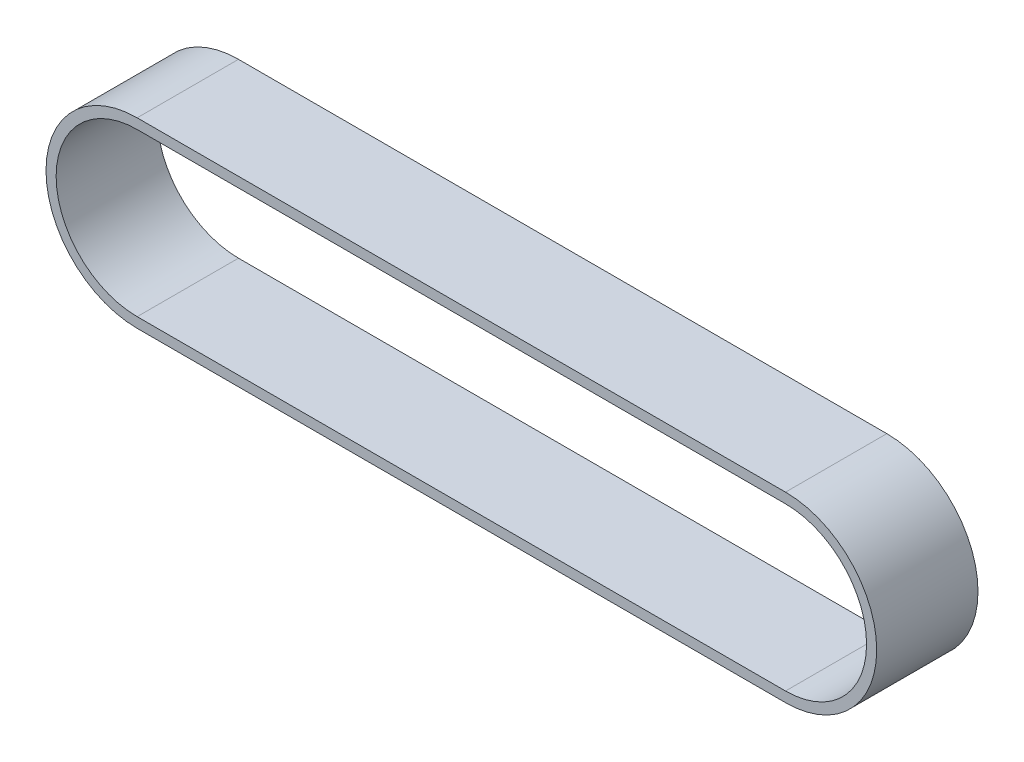
ISO-10303-21;
HEADER;
FILE_DESCRIPTION(('STEP AP214'),'2;1');
FILE_NAME('part.step','',(''),(''),'','','');
FILE_SCHEMA(('AUTOMOTIVE_DESIGN { 1 0 10303 214 1 1 1 1 }'));
ENDSEC;
DATA;
#1=APPLICATION_CONTEXT('core data for automotive mechanical design processes');
#2=APPLICATION_PROTOCOL_DEFINITION('international standard','automotive_design',2000,#1);
#3=PRODUCT_CONTEXT('',#1,'mechanical');
#4=PRODUCT('Part','Part','',(#3));
#5=PRODUCT_RELATED_PRODUCT_CATEGORY('part','',(#4));
#6=PRODUCT_DEFINITION_FORMATION('','',#4);
#7=PRODUCT_DEFINITION_CONTEXT('part definition',#1,'design');
#8=PRODUCT_DEFINITION('design','',#6,#7);
#9=PRODUCT_DEFINITION_SHAPE('','',#8);
#10=(LENGTH_UNIT() NAMED_UNIT(*) SI_UNIT(.MILLI.,.METRE.));
#11=(NAMED_UNIT(*) PLANE_ANGLE_UNIT() SI_UNIT($,.RADIAN.));
#12=(NAMED_UNIT(*) SI_UNIT($,.STERADIAN.) SOLID_ANGLE_UNIT());
#13=UNCERTAINTY_MEASURE_WITH_UNIT(LENGTH_MEASURE(1.E-05),#10,'distance_accuracy_value','');
#14=(GEOMETRIC_REPRESENTATION_CONTEXT(3) GLOBAL_UNCERTAINTY_ASSIGNED_CONTEXT((#13)) GLOBAL_UNIT_ASSIGNED_CONTEXT((#10,
#11,#12)) REPRESENTATION_CONTEXT('',''));
#15=CARTESIAN_POINT('',(0.,0.,0.));
#16=DIRECTION('',(0.,0.,1.));
#17=DIRECTION('',(1.,0.,0.));
#18=AXIS2_PLACEMENT_3D('',#15,#16,#17);
#19=CARTESIAN_POINT('',(0.,0.,50.));
#20=DIRECTION('',(0.,0.,1.));
#21=DIRECTION('',(1.,0.,0.));
#22=AXIS2_PLACEMENT_3D('',#19,#20,#21);
#23=PLANE('',#22);
#24=CARTESIAN_POINT('',(0.,0.,50.));
#25=DIRECTION('',(0.,0.,1.));
#26=DIRECTION('',(1.,0.,0.));
#27=AXIS2_PLACEMENT_3D('',#24,#25,#26);
#28=CIRCLE('',#27,45.);
#29=CARTESIAN_POINT('',(0.,45.,50.));
#30=VERTEX_POINT('',#29);
#31=CARTESIAN_POINT('',(0.,-45.,50.));
#32=VERTEX_POINT('',#31);
#33=EDGE_CURVE('E157',#30,#32,#28,.T.);
#34=ORIENTED_EDGE('',*,*,#33,.T.);
#35=DIRECTION('',(1.,0.,0.));
#36=VECTOR('',#35,1.);
#37=CARTESIAN_POINT('',(0.,-45.,50.));
#38=LINE('',#37,#36);
#39=CARTESIAN_POINT('',(320.,-45.,50.));
#40=VERTEX_POINT('',#39);
#41=EDGE_CURVE('E161',#32,#40,#38,.T.);
#42=ORIENTED_EDGE('',*,*,#41,.T.);
#43=CARTESIAN_POINT('',(320.,0.,50.));
#44=DIRECTION('',(0.,0.,1.));
#45=DIRECTION('',(1.,0.,0.));
#46=AXIS2_PLACEMENT_3D('',#43,#44,#45);
#47=CIRCLE('',#46,45.);
#48=CARTESIAN_POINT('',(320.,45.,50.));
#49=VERTEX_POINT('',#48);
#50=EDGE_CURVE('E165',#40,#49,#47,.T.);
#51=ORIENTED_EDGE('',*,*,#50,.T.);
#52=DIRECTION('',(-1.,0.,0.));
#53=VECTOR('',#52,1.);
#54=CARTESIAN_POINT('',(0.,45.,50.));
#55=LINE('',#54,#53);
#56=EDGE_CURVE('E168',#49,#30,#55,.T.);
#57=ORIENTED_EDGE('',*,*,#56,.T.);
#58=EDGE_LOOP('',(#34,#42,#51,#57));
#59=FACE_BOUND('',#58,.T.);
#60=DIRECTION('',(1.,0.,0.));
#61=VECTOR('',#60,1.);
#62=CARTESIAN_POINT('',(0.,-40.,50.));
#63=LINE('',#62,#61);
#64=CARTESIAN_POINT('',(0.,-40.,50.));
#65=VERTEX_POINT('',#64);
#66=CARTESIAN_POINT('',(320.,-40.,50.));
#67=VERTEX_POINT('',#66);
#68=EDGE_CURVE('E118',#65,#67,#63,.T.);
#69=ORIENTED_EDGE('',*,*,#68,.F.);
#70=CARTESIAN_POINT('',(0.,0.,50.));
#71=DIRECTION('',(0.,0.,1.));
#72=DIRECTION('',(1.,0.,0.));
#73=AXIS2_PLACEMENT_3D('',#70,#71,#72);
#74=CIRCLE('',#73,40.);
#75=CARTESIAN_POINT('',(0.,40.,50.));
#76=VERTEX_POINT('',#75);
#77=EDGE_CURVE('E109',#76,#65,#74,.T.);
#78=ORIENTED_EDGE('',*,*,#77,.F.);
#79=DIRECTION('',(-1.,0.,0.));
#80=VECTOR('',#79,1.);
#81=CARTESIAN_POINT('',(0.,40.,50.));
#82=LINE('',#81,#80);
#83=CARTESIAN_POINT('',(320.,40.,50.));
#84=VERTEX_POINT('',#83);
#85=EDGE_CURVE('E135',#84,#76,#82,.T.);
#86=ORIENTED_EDGE('',*,*,#85,.F.);
#87=CARTESIAN_POINT('',(320.,0.,50.));
#88=DIRECTION('',(0.,0.,1.));
#89=DIRECTION('',(1.,0.,0.));
#90=AXIS2_PLACEMENT_3D('',#87,#88,#89);
#91=CIRCLE('',#90,40.);
#92=EDGE_CURVE('E131',#67,#84,#91,.T.);
#93=ORIENTED_EDGE('',*,*,#92,.F.);
#94=EDGE_LOOP('',(#69,#78,#86,#93));
#95=FACE_BOUND('',#94,.T.);
#96=ADVANCED_FACE('F43',(#59,#95),#23,.T.);
#97=CARTESIAN_POINT('',(0.,0.,0.));
#98=DIRECTION('',(0.,0.,1.));
#99=DIRECTION('',(1.,0.,0.));
#100=AXIS2_PLACEMENT_3D('',#97,#98,#99);
#101=PLANE('',#100);
#102=CARTESIAN_POINT('',(0.,0.,0.));
#103=DIRECTION('',(0.,0.,1.));
#104=DIRECTION('',(1.,0.,0.));
#105=AXIS2_PLACEMENT_3D('',#102,#103,#104);
#106=CIRCLE('',#105,45.);
#107=CARTESIAN_POINT('',(0.,45.,0.));
#108=VERTEX_POINT('',#107);
#109=CARTESIAN_POINT('',(0.,-45.,0.));
#110=VERTEX_POINT('',#109);
#111=EDGE_CURVE('E127',#108,#110,#106,.T.);
#112=ORIENTED_EDGE('',*,*,#111,.F.);
#113=DIRECTION('',(-1.,0.,0.));
#114=VECTOR('',#113,1.);
#115=CARTESIAN_POINT('',(0.,45.,0.));
#116=LINE('',#115,#114);
#117=CARTESIAN_POINT('',(320.,45.,0.));
#118=VERTEX_POINT('',#117);
#119=EDGE_CURVE('E162',#118,#108,#116,.T.);
#120=ORIENTED_EDGE('',*,*,#119,.F.);
#121=CARTESIAN_POINT('',(320.,0.,0.));
#122=DIRECTION('',(0.,0.,1.));
#123=DIRECTION('',(1.,0.,0.));
#124=AXIS2_PLACEMENT_3D('',#121,#122,#123);
#125=CIRCLE('',#124,45.);
#126=CARTESIAN_POINT('',(320.,-45.,0.));
#127=VERTEX_POINT('',#126);
#128=EDGE_CURVE('E178',#127,#118,#125,.T.);
#129=ORIENTED_EDGE('',*,*,#128,.F.);
#130=DIRECTION('',(1.,0.,0.));
#131=VECTOR('',#130,1.);
#132=CARTESIAN_POINT('',(0.,-45.,0.));
#133=LINE('',#132,#131);
#134=EDGE_CURVE('E175',#110,#127,#133,.T.);
#135=ORIENTED_EDGE('',*,*,#134,.F.);
#136=EDGE_LOOP('',(#112,#120,#129,#135));
#137=FACE_BOUND('',#136,.T.);
#138=CARTESIAN_POINT('',(0.,0.,0.));
#139=DIRECTION('',(0.,0.,1.));
#140=DIRECTION('',(1.,0.,0.));
#141=AXIS2_PLACEMENT_3D('',#138,#139,#140);
#142=CIRCLE('',#141,40.);
#143=CARTESIAN_POINT('',(0.,40.,0.));
#144=VERTEX_POINT('',#143);
#145=CARTESIAN_POINT('',(0.,-40.,0.));
#146=VERTEX_POINT('',#145);
#147=EDGE_CURVE('E67',#144,#146,#142,.T.);
#148=ORIENTED_EDGE('',*,*,#147,.T.);
#149=DIRECTION('',(1.,0.,0.));
#150=VECTOR('',#149,1.);
#151=CARTESIAN_POINT('',(0.,-40.,0.));
#152=LINE('',#151,#150);
#153=CARTESIAN_POINT('',(320.,-40.,0.));
#154=VERTEX_POINT('',#153);
#155=EDGE_CURVE('E125',#146,#154,#152,.T.);
#156=ORIENTED_EDGE('',*,*,#155,.T.);
#157=CARTESIAN_POINT('',(320.,0.,0.));
#158=DIRECTION('',(0.,0.,1.));
#159=DIRECTION('',(1.,0.,0.));
#160=AXIS2_PLACEMENT_3D('',#157,#158,#159);
#161=CIRCLE('',#160,40.);
#162=CARTESIAN_POINT('',(320.,40.,0.));
#163=VERTEX_POINT('',#162);
#164=EDGE_CURVE('E144',#154,#163,#161,.T.);
#165=ORIENTED_EDGE('',*,*,#164,.T.);
#166=DIRECTION('',(-1.,0.,0.));
#167=VECTOR('',#166,1.);
#168=CARTESIAN_POINT('',(0.,40.,0.));
#169=LINE('',#168,#167);
#170=EDGE_CURVE('E119',#163,#144,#169,.T.);
#171=ORIENTED_EDGE('',*,*,#170,.T.);
#172=EDGE_LOOP('',(#148,#156,#165,#171));
#173=FACE_BOUND('',#172,.T.);
#174=ADVANCED_FACE('F201',(#137,#173),#101,.F.);
#175=CARTESIAN_POINT('',(0.,0.,50.));
#176=DIRECTION('',(0.,0.,-1.));
#177=DIRECTION('',(-1.,0.,0.));
#178=AXIS2_PLACEMENT_3D('',#175,#176,#177);
#179=CYLINDRICAL_SURFACE('',#178,45.);
#180=ORIENTED_EDGE('',*,*,#111,.T.);
#181=DIRECTION('',(0.,0.,-1.));
#182=VECTOR('',#181,1.);
#183=CARTESIAN_POINT('',(0.,-45.,50.));
#184=LINE('',#183,#182);
#185=EDGE_CURVE('E11',#32,#110,#184,.T.);
#186=ORIENTED_EDGE('',*,*,#185,.F.);
#187=ORIENTED_EDGE('',*,*,#33,.F.);
#188=DIRECTION('',(0.,0.,-1.));
#189=VECTOR('',#188,1.);
#190=CARTESIAN_POINT('',(0.,45.,50.));
#191=LINE('',#190,#189);
#192=EDGE_CURVE('E171',#30,#108,#191,.T.);
#193=ORIENTED_EDGE('',*,*,#192,.T.);
#194=EDGE_LOOP('',(#180,#186,#187,#193));
#195=FACE_BOUND('',#194,.T.);
#196=ADVANCED_FACE('F45',(#195),#179,.T.);
#197=CARTESIAN_POINT('',(0.,-45.,50.));
#198=DIRECTION('',(0.,1.,0.));
#199=DIRECTION('',(0.,0.,1.));
#200=AXIS2_PLACEMENT_3D('',#197,#198,#199);
#201=PLANE('',#200);
#202=ORIENTED_EDGE('',*,*,#134,.T.);
#203=DIRECTION('',(0.,0.,-1.));
#204=VECTOR('',#203,1.);
#205=CARTESIAN_POINT('',(320.,-45.,50.));
#206=LINE('',#205,#204);
#207=EDGE_CURVE('E52',#40,#127,#206,.T.);
#208=ORIENTED_EDGE('',*,*,#207,.F.);
#209=ORIENTED_EDGE('',*,*,#41,.F.);
#210=ORIENTED_EDGE('',*,*,#185,.T.);
#211=EDGE_LOOP('',(#202,#208,#209,#210));
#212=FACE_BOUND('',#211,.T.);
#213=ADVANCED_FACE('F211',(#212),#201,.F.);
#214=CARTESIAN_POINT('',(320.,0.,50.));
#215=DIRECTION('',(0.,0.,-1.));
#216=DIRECTION('',(-1.,0.,0.));
#217=AXIS2_PLACEMENT_3D('',#214,#215,#216);
#218=CYLINDRICAL_SURFACE('',#217,45.);
#219=ORIENTED_EDGE('',*,*,#128,.T.);
#220=DIRECTION('',(0.,0.,-1.));
#221=VECTOR('',#220,1.);
#222=CARTESIAN_POINT('',(320.,45.,50.));
#223=LINE('',#222,#221);
#224=EDGE_CURVE('E186',#49,#118,#223,.T.);
#225=ORIENTED_EDGE('',*,*,#224,.F.);
#226=ORIENTED_EDGE('',*,*,#50,.F.);
#227=ORIENTED_EDGE('',*,*,#207,.T.);
#228=EDGE_LOOP('',(#219,#225,#226,#227));
#229=FACE_BOUND('',#228,.T.);
#230=ADVANCED_FACE('F195',(#229),#218,.T.);
#231=CARTESIAN_POINT('',(0.,45.,50.));
#232=DIRECTION('',(0.,-1.,0.));
#233=DIRECTION('',(0.,0.,-1.));
#234=AXIS2_PLACEMENT_3D('',#231,#232,#233);
#235=PLANE('',#234);
#236=ORIENTED_EDGE('',*,*,#119,.T.);
#237=ORIENTED_EDGE('',*,*,#192,.F.);
#238=ORIENTED_EDGE('',*,*,#56,.F.);
#239=ORIENTED_EDGE('',*,*,#224,.T.);
#240=EDGE_LOOP('',(#236,#237,#238,#239));
#241=FACE_BOUND('',#240,.T.);
#242=ADVANCED_FACE('F205',(#241),#235,.F.);
#243=CARTESIAN_POINT('',(0.,0.,50.));
#244=DIRECTION('',(0.,0.,-1.));
#245=DIRECTION('',(-1.,0.,0.));
#246=AXIS2_PLACEMENT_3D('',#243,#244,#245);
#247=CYLINDRICAL_SURFACE('',#246,40.);
#248=ORIENTED_EDGE('',*,*,#147,.F.);
#249=DIRECTION('',(0.,0.,-1.));
#250=VECTOR('',#249,1.);
#251=CARTESIAN_POINT('',(0.,40.,50.));
#252=LINE('',#251,#250);
#253=EDGE_CURVE('E113',#76,#144,#252,.T.);
#254=ORIENTED_EDGE('',*,*,#253,.F.);
#255=ORIENTED_EDGE('',*,*,#77,.T.);
#256=DIRECTION('',(0.,0.,-1.));
#257=VECTOR('',#256,1.);
#258=CARTESIAN_POINT('',(0.,-40.,50.));
#259=LINE('',#258,#257);
#260=EDGE_CURVE('E112',#65,#146,#259,.T.);
#261=ORIENTED_EDGE('',*,*,#260,.T.);
#262=EDGE_LOOP('',(#248,#254,#255,#261));
#263=FACE_BOUND('',#262,.T.);
#264=ADVANCED_FACE('F111',(#263),#247,.F.);
#265=CARTESIAN_POINT('',(0.,-40.,50.));
#266=DIRECTION('',(0.,1.,0.));
#267=DIRECTION('',(0.,0.,1.));
#268=AXIS2_PLACEMENT_3D('',#265,#266,#267);
#269=PLANE('',#268);
#270=ORIENTED_EDGE('',*,*,#155,.F.);
#271=ORIENTED_EDGE('',*,*,#260,.F.);
#272=ORIENTED_EDGE('',*,*,#68,.T.);
#273=DIRECTION('',(0.,0.,-1.));
#274=VECTOR('',#273,1.);
#275=CARTESIAN_POINT('',(320.,-40.,50.));
#276=LINE('',#275,#274);
#277=EDGE_CURVE('E128',#67,#154,#276,.T.);
#278=ORIENTED_EDGE('',*,*,#277,.T.);
#279=EDGE_LOOP('',(#270,#271,#272,#278));
#280=FACE_BOUND('',#279,.T.);
#281=ADVANCED_FACE('F122',(#280),#269,.T.);
#282=CARTESIAN_POINT('',(320.,0.,50.));
#283=DIRECTION('',(0.,0.,-1.));
#284=DIRECTION('',(-1.,0.,0.));
#285=AXIS2_PLACEMENT_3D('',#282,#283,#284);
#286=CYLINDRICAL_SURFACE('',#285,40.);
#287=ORIENTED_EDGE('',*,*,#164,.F.);
#288=ORIENTED_EDGE('',*,*,#277,.F.);
#289=ORIENTED_EDGE('',*,*,#92,.T.);
#290=DIRECTION('',(0.,0.,-1.));
#291=VECTOR('',#290,1.);
#292=CARTESIAN_POINT('',(320.,40.,50.));
#293=LINE('',#292,#291);
#294=EDGE_CURVE('E59',#84,#163,#293,.T.);
#295=ORIENTED_EDGE('',*,*,#294,.T.);
#296=EDGE_LOOP('',(#287,#288,#289,#295));
#297=FACE_BOUND('',#296,.T.);
#298=ADVANCED_FACE('F234',(#297),#286,.F.);
#299=CARTESIAN_POINT('',(0.,40.,50.));
#300=DIRECTION('',(0.,-1.,0.));
#301=DIRECTION('',(0.,0.,-1.));
#302=AXIS2_PLACEMENT_3D('',#299,#300,#301);
#303=PLANE('',#302);
#304=ORIENTED_EDGE('',*,*,#170,.F.);
#305=ORIENTED_EDGE('',*,*,#294,.F.);
#306=ORIENTED_EDGE('',*,*,#85,.T.);
#307=ORIENTED_EDGE('',*,*,#253,.T.);
#308=EDGE_LOOP('',(#304,#305,#306,#307));
#309=FACE_BOUND('',#308,.T.);
#310=ADVANCED_FACE('F238',(#309),#303,.T.);
#311=CLOSED_SHELL('',(#96,#174,#196,#213,#230,#242,#264,#281,#298,#310));
#312=MANIFOLD_SOLID_BREP('B2',#311);
#313=ADVANCED_BREP_SHAPE_REPRESENTATION('',(#18,#312),#14);
#314=SHAPE_DEFINITION_REPRESENTATION(#9,#313);
ENDSEC;
END-ISO-10303-21;
